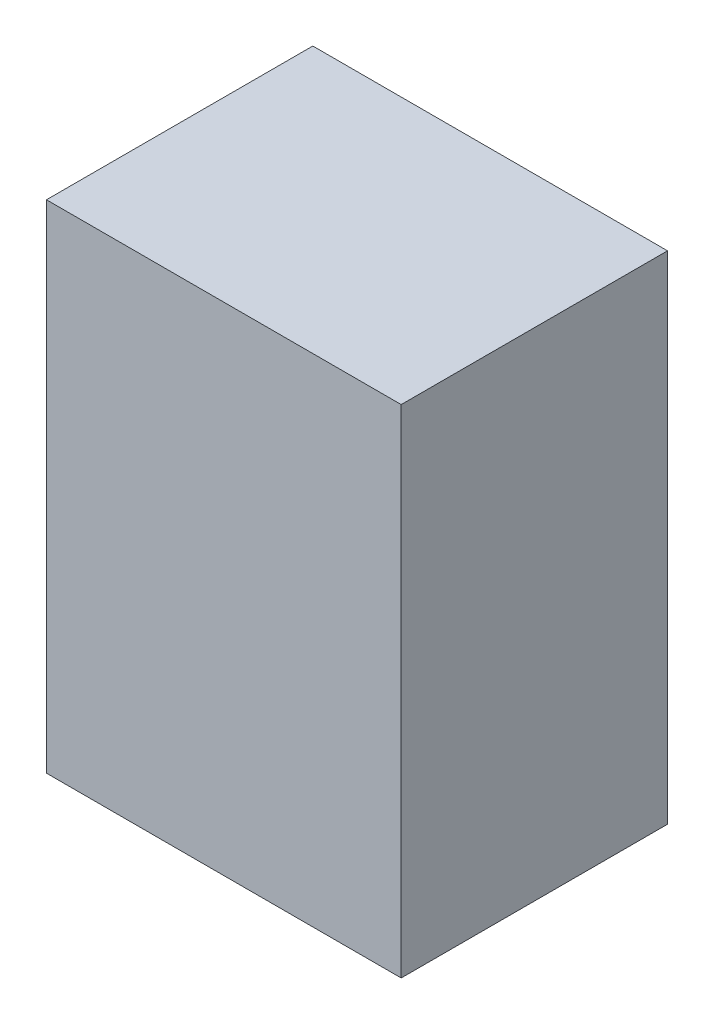
ISO-10303-21;
HEADER;
FILE_DESCRIPTION(('STEP AP214'),'2;1');
FILE_NAME('part.step','',(''),(''),'','','');
FILE_SCHEMA(('AUTOMOTIVE_DESIGN { 1 0 10303 214 1 1 1 1 }'));
ENDSEC;
DATA;
#1=APPLICATION_CONTEXT('core data for automotive mechanical design processes');
#2=APPLICATION_PROTOCOL_DEFINITION('international standard','automotive_design',2000,#1);
#3=PRODUCT_CONTEXT('',#1,'mechanical');
#4=PRODUCT('Part','Part','',(#3));
#5=PRODUCT_RELATED_PRODUCT_CATEGORY('part','',(#4));
#6=PRODUCT_DEFINITION_FORMATION('','',#4);
#7=PRODUCT_DEFINITION_CONTEXT('part definition',#1,'design');
#8=PRODUCT_DEFINITION('design','',#6,#7);
#9=PRODUCT_DEFINITION_SHAPE('','',#8);
#10=(LENGTH_UNIT() NAMED_UNIT(*) SI_UNIT(.MILLI.,.METRE.));
#11=(NAMED_UNIT(*) PLANE_ANGLE_UNIT() SI_UNIT($,.RADIAN.));
#12=(NAMED_UNIT(*) SI_UNIT($,.STERADIAN.) SOLID_ANGLE_UNIT());
#13=UNCERTAINTY_MEASURE_WITH_UNIT(LENGTH_MEASURE(1.E-05),#10,'distance_accuracy_value','');
#14=(GEOMETRIC_REPRESENTATION_CONTEXT(3) GLOBAL_UNCERTAINTY_ASSIGNED_CONTEXT((#13)) GLOBAL_UNIT_ASSIGNED_CONTEXT((#10,
#11,#12)) REPRESENTATION_CONTEXT('',''));
#15=CARTESIAN_POINT('',(0.,0.,0.));
#16=DIRECTION('',(0.,0.,1.));
#17=DIRECTION('',(1.,0.,0.));
#18=AXIS2_PLACEMENT_3D('',#15,#16,#17);
#19=CARTESIAN_POINT('',(12.5,-17.5,18.77));
#20=DIRECTION('',(-1.,0.,0.));
#21=DIRECTION('',(0.,0.,1.));
#22=AXIS2_PLACEMENT_3D('',#19,#20,#21);
#23=PLANE('',#22);
#24=DIRECTION('',(0.,1.,0.));
#25=VECTOR('',#24,1.);
#26=CARTESIAN_POINT('',(12.5,-17.5,0.));
#27=LINE('',#26,#25);
#28=CARTESIAN_POINT('',(12.5,-17.5,0.));
#29=VERTEX_POINT('',#28);
#30=CARTESIAN_POINT('',(12.5,17.5,0.));
#31=VERTEX_POINT('',#30);
#32=EDGE_CURVE('E98',#29,#31,#27,.T.);
#33=ORIENTED_EDGE('',*,*,#32,.T.);
#34=DIRECTION('',(0.,0.,-1.));
#35=VECTOR('',#34,1.);
#36=CARTESIAN_POINT('',(12.5,17.5,18.77));
#37=LINE('',#36,#35);
#38=CARTESIAN_POINT('',(12.5,17.5,18.77));
#39=VERTEX_POINT('',#38);
#40=EDGE_CURVE('E11',#39,#31,#37,.T.);
#41=ORIENTED_EDGE('',*,*,#40,.F.);
#42=DIRECTION('',(0.,1.,0.));
#43=VECTOR('',#42,1.);
#44=CARTESIAN_POINT('',(12.5,-17.5,18.77));
#45=LINE('',#44,#43);
#46=CARTESIAN_POINT('',(12.5,-17.5,18.77));
#47=VERTEX_POINT('',#46);
#48=EDGE_CURVE('E86',#47,#39,#45,.T.);
#49=ORIENTED_EDGE('',*,*,#48,.F.);
#50=DIRECTION('',(0.,0.,-1.));
#51=VECTOR('',#50,1.);
#52=CARTESIAN_POINT('',(12.5,-17.5,18.77));
#53=LINE('',#52,#51);
#54=EDGE_CURVE('E94',#47,#29,#53,.T.);
#55=ORIENTED_EDGE('',*,*,#54,.T.);
#56=EDGE_LOOP('',(#33,#41,#49,#55));
#57=FACE_BOUND('',#56,.T.);
#58=ADVANCED_FACE('F35',(#57),#23,.F.);
#59=CARTESIAN_POINT('',(-12.5,17.5,18.77));
#60=DIRECTION('',(0.,-1.,0.));
#61=DIRECTION('',(0.,0.,-1.));
#62=AXIS2_PLACEMENT_3D('',#59,#60,#61);
#63=PLANE('',#62);
#64=DIRECTION('',(-1.,0.,0.));
#65=VECTOR('',#64,1.);
#66=CARTESIAN_POINT('',(-12.5,17.5,0.));
#67=LINE('',#66,#65);
#68=CARTESIAN_POINT('',(-12.5,17.5,0.));
#69=VERTEX_POINT('',#68);
#70=EDGE_CURVE('E90',#31,#69,#67,.T.);
#71=ORIENTED_EDGE('',*,*,#70,.T.);
#72=DIRECTION('',(0.,0.,-1.));
#73=VECTOR('',#72,1.);
#74=CARTESIAN_POINT('',(-12.5,17.5,18.77));
#75=LINE('',#74,#73);
#76=CARTESIAN_POINT('',(-12.5,17.5,18.77));
#77=VERTEX_POINT('',#76);
#78=EDGE_CURVE('E43',#77,#69,#75,.T.);
#79=ORIENTED_EDGE('',*,*,#78,.F.);
#80=DIRECTION('',(-1.,0.,0.));
#81=VECTOR('',#80,1.);
#82=CARTESIAN_POINT('',(-12.5,17.5,18.77));
#83=LINE('',#82,#81);
#84=EDGE_CURVE('E81',#39,#77,#83,.T.);
#85=ORIENTED_EDGE('',*,*,#84,.F.);
#86=ORIENTED_EDGE('',*,*,#40,.T.);
#87=EDGE_LOOP('',(#71,#79,#85,#86));
#88=FACE_BOUND('',#87,.T.);
#89=ADVANCED_FACE('F89',(#88),#63,.F.);
#90=CARTESIAN_POINT('',(-12.5,-17.5,18.77));
#91=DIRECTION('',(1.,0.,0.));
#92=DIRECTION('',(0.,0.,-1.));
#93=AXIS2_PLACEMENT_3D('',#90,#91,#92);
#94=PLANE('',#93);
#95=DIRECTION('',(0.,-1.,0.));
#96=VECTOR('',#95,1.);
#97=CARTESIAN_POINT('',(-12.5,-17.5,0.));
#98=LINE('',#97,#96);
#99=CARTESIAN_POINT('',(-12.5,-17.5,0.));
#100=VERTEX_POINT('',#99);
#101=EDGE_CURVE('E68',#69,#100,#98,.T.);
#102=ORIENTED_EDGE('',*,*,#101,.T.);
#103=DIRECTION('',(0.,0.,-1.));
#104=VECTOR('',#103,1.);
#105=CARTESIAN_POINT('',(-12.5,-17.5,18.77));
#106=LINE('',#105,#104);
#107=CARTESIAN_POINT('',(-12.5,-17.5,18.77));
#108=VERTEX_POINT('',#107);
#109=EDGE_CURVE('E91',#108,#100,#106,.T.);
#110=ORIENTED_EDGE('',*,*,#109,.F.);
#111=DIRECTION('',(0.,-1.,0.));
#112=VECTOR('',#111,1.);
#113=CARTESIAN_POINT('',(-12.5,-17.5,18.77));
#114=LINE('',#113,#112);
#115=EDGE_CURVE('E84',#77,#108,#114,.T.);
#116=ORIENTED_EDGE('',*,*,#115,.F.);
#117=ORIENTED_EDGE('',*,*,#78,.T.);
#118=EDGE_LOOP('',(#102,#110,#116,#117));
#119=FACE_BOUND('',#118,.T.);
#120=ADVANCED_FACE('F92',(#119),#94,.F.);
#121=CARTESIAN_POINT('',(-12.5,-17.5,18.77));
#122=DIRECTION('',(0.,1.,0.));
#123=DIRECTION('',(0.,0.,1.));
#124=AXIS2_PLACEMENT_3D('',#121,#122,#123);
#125=PLANE('',#124);
#126=DIRECTION('',(1.,0.,0.));
#127=VECTOR('',#126,1.);
#128=CARTESIAN_POINT('',(-12.5,-17.5,0.));
#129=LINE('',#128,#127);
#130=EDGE_CURVE('E74',#100,#29,#129,.T.);
#131=ORIENTED_EDGE('',*,*,#130,.T.);
#132=ORIENTED_EDGE('',*,*,#54,.F.);
#133=DIRECTION('',(1.,0.,0.));
#134=VECTOR('',#133,1.);
#135=CARTESIAN_POINT('',(-12.5,-17.5,18.77));
#136=LINE('',#135,#134);
#137=EDGE_CURVE('E51',#108,#47,#136,.T.);
#138=ORIENTED_EDGE('',*,*,#137,.F.);
#139=ORIENTED_EDGE('',*,*,#109,.T.);
#140=EDGE_LOOP('',(#131,#132,#138,#139));
#141=FACE_BOUND('',#140,.T.);
#142=ADVANCED_FACE('F105',(#141),#125,.F.);
#143=CARTESIAN_POINT('',(0.,0.,18.77));
#144=DIRECTION('',(0.,0.,-1.));
#145=DIRECTION('',(-1.,0.,0.));
#146=AXIS2_PLACEMENT_3D('',#143,#144,#145);
#147=PLANE('',#146);
#148=ORIENTED_EDGE('',*,*,#48,.T.);
#149=ORIENTED_EDGE('',*,*,#84,.T.);
#150=ORIENTED_EDGE('',*,*,#115,.T.);
#151=ORIENTED_EDGE('',*,*,#137,.T.);
#152=EDGE_LOOP('',(#148,#149,#150,#151));
#153=FACE_BOUND('',#152,.T.);
#154=ADVANCED_FACE('F82',(#153),#147,.F.);
#155=CARTESIAN_POINT('',(0.,0.,0.));
#156=DIRECTION('',(0.,0.,-1.));
#157=DIRECTION('',(-1.,0.,0.));
#158=AXIS2_PLACEMENT_3D('',#155,#156,#157);
#159=PLANE('',#158);
#160=ORIENTED_EDGE('',*,*,#32,.F.);
#161=ORIENTED_EDGE('',*,*,#130,.F.);
#162=ORIENTED_EDGE('',*,*,#101,.F.);
#163=ORIENTED_EDGE('',*,*,#70,.F.);
#164=EDGE_LOOP('',(#160,#161,#162,#163));
#165=FACE_BOUND('',#164,.T.);
#166=ADVANCED_FACE('F108',(#165),#159,.T.);
#167=CLOSED_SHELL('',(#58,#89,#120,#142,#154,#166));
#168=MANIFOLD_SOLID_BREP('B2',#167);
#169=ADVANCED_BREP_SHAPE_REPRESENTATION('',(#18,#168),#14);
#170=SHAPE_DEFINITION_REPRESENTATION(#9,#169);
ENDSEC;
END-ISO-10303-21;
